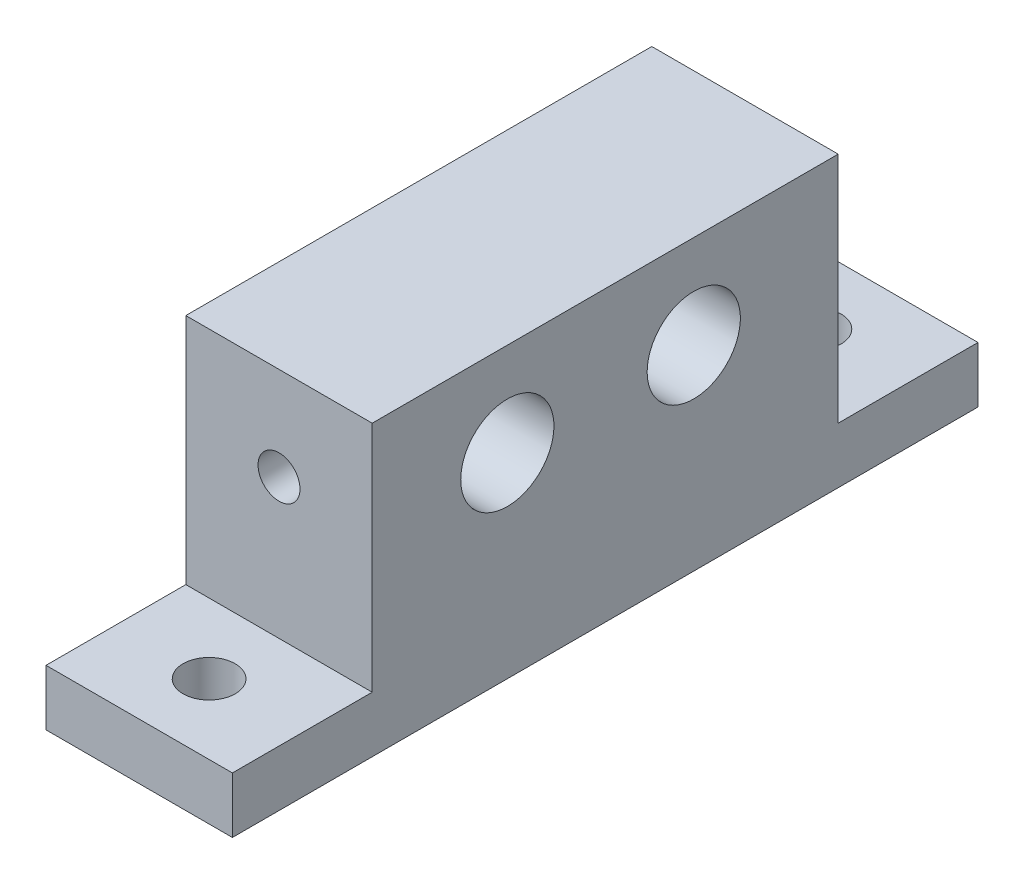
ISO-10303-21;
HEADER;
FILE_DESCRIPTION(('STEP AP214'),'2;1');
FILE_NAME('part.step','',(''),(''),'','','');
FILE_SCHEMA(('AUTOMOTIVE_DESIGN { 1 0 10303 214 1 1 1 1 }'));
ENDSEC;
DATA;
#1=APPLICATION_CONTEXT('core data for automotive mechanical design processes');
#2=APPLICATION_PROTOCOL_DEFINITION('international standard','automotive_design',2000,#1);
#3=PRODUCT_CONTEXT('',#1,'mechanical');
#4=PRODUCT('Part','Part','',(#3));
#5=PRODUCT_RELATED_PRODUCT_CATEGORY('part','',(#4));
#6=PRODUCT_DEFINITION_FORMATION('','',#4);
#7=PRODUCT_DEFINITION_CONTEXT('part definition',#1,'design');
#8=PRODUCT_DEFINITION('design','',#6,#7);
#9=PRODUCT_DEFINITION_SHAPE('','',#8);
#10=(LENGTH_UNIT() NAMED_UNIT(*) SI_UNIT(.MILLI.,.METRE.));
#11=(NAMED_UNIT(*) PLANE_ANGLE_UNIT() SI_UNIT($,.RADIAN.));
#12=(NAMED_UNIT(*) SI_UNIT($,.STERADIAN.) SOLID_ANGLE_UNIT());
#13=UNCERTAINTY_MEASURE_WITH_UNIT(LENGTH_MEASURE(1.E-05),#10,'distance_accuracy_value','');
#14=(GEOMETRIC_REPRESENTATION_CONTEXT(3) GLOBAL_UNCERTAINTY_ASSIGNED_CONTEXT((#13)) GLOBAL_UNIT_ASSIGNED_CONTEXT((#10,
#11,#12)) REPRESENTATION_CONTEXT('',''));
#15=CARTESIAN_POINT('',(0.,0.,0.));
#16=DIRECTION('',(0.,0.,1.));
#17=DIRECTION('',(1.,0.,0.));
#18=AXIS2_PLACEMENT_3D('',#15,#16,#17);
#19=CARTESIAN_POINT('',(0.906040268456394,10.,-23.1040268456376));
#20=DIRECTION('',(-1.,0.,0.));
#21=DIRECTION('',(0.,0.,1.));
#22=AXIS2_PLACEMENT_3D('',#19,#20,#21);
#23=PLANE('',#22);
#24=CARTESIAN_POINT('',(0.906040268456395,5.,-15.3540268456376));
#25=DIRECTION('',(-1.,0.,0.));
#26=DIRECTION('',(0.,0.,1.));
#27=AXIS2_PLACEMENT_3D('',#24,#25,#26);
#28=CIRCLE('',#27,2.5);
#29=CARTESIAN_POINT('',(0.906040268456395,5.,-12.8540268456376));
#30=VERTEX_POINT('',#29);
#31=EDGE_CURVE('E183',#30,#30,#28,.T.);
#32=ORIENTED_EDGE('',*,*,#31,.T.);
#33=EDGE_LOOP('',(#32));
#34=FACE_BOUND('',#33,.T.);
#35=CARTESIAN_POINT('',(0.906040268456396,5.,-5.35402684563758));
#36=DIRECTION('',(-1.,0.,0.));
#37=DIRECTION('',(0.,0.,1.));
#38=AXIS2_PLACEMENT_3D('',#35,#36,#37);
#39=CIRCLE('',#38,2.5);
#40=CARTESIAN_POINT('',(0.906040268456397,5.,-2.85402684563758));
#41=VERTEX_POINT('',#40);
#42=EDGE_CURVE('E186',#41,#41,#39,.T.);
#43=ORIENTED_EDGE('',*,*,#42,.T.);
#44=EDGE_LOOP('',(#43));
#45=FACE_BOUND('',#44,.T.);
#46=DIRECTION('',(0.,-1.,0.));
#47=VECTOR('',#46,1.);
#48=CARTESIAN_POINT('',(0.906040268456397,10.,1.89597315436242));
#49=LINE('',#48,#47);
#50=CARTESIAN_POINT('',(0.906040268456397,10.,1.89597315436242));
#51=VERTEX_POINT('',#50);
#52=CARTESIAN_POINT('',(0.906040268456397,-2.5,1.89597315436242));
#53=VERTEX_POINT('',#52);
#54=EDGE_CURVE('E202',#51,#53,#49,.T.);
#55=ORIENTED_EDGE('',*,*,#54,.T.);
#56=DIRECTION('',(0.,0.,1.));
#57=VECTOR('',#56,1.);
#58=CARTESIAN_POINT('',(0.906040268456399,-2.5,-30.6040268456376));
#59=LINE('',#58,#57);
#60=CARTESIAN_POINT('',(0.906040268456399,-2.5,9.39597315436242));
#61=VERTEX_POINT('',#60);
#62=EDGE_CURVE('E117',#53,#61,#59,.T.);
#63=ORIENTED_EDGE('',*,*,#62,.T.);
#64=DIRECTION('',(0.,1.,0.));
#65=VECTOR('',#64,1.);
#66=CARTESIAN_POINT('',(0.906040268456399,-5.5,9.39597315436242));
#67=LINE('',#66,#65);
#68=CARTESIAN_POINT('',(0.906040268456399,-5.5,9.39597315436242));
#69=VERTEX_POINT('',#68);
#70=EDGE_CURVE('E99',#69,#61,#67,.T.);
#71=ORIENTED_EDGE('',*,*,#70,.F.);
#72=DIRECTION('',(0.,0.,1.));
#73=VECTOR('',#72,1.);
#74=CARTESIAN_POINT('',(0.906040268456399,-5.5,-30.6040268456376));
#75=LINE('',#74,#73);
#76=CARTESIAN_POINT('',(0.906040268456399,-5.5,-30.6040268456376));
#77=VERTEX_POINT('',#76);
#78=EDGE_CURVE('E105',#77,#69,#75,.T.);
#79=ORIENTED_EDGE('',*,*,#78,.F.);
#80=DIRECTION('',(0.,1.,0.));
#81=VECTOR('',#80,1.);
#82=CARTESIAN_POINT('',(0.906040268456399,-5.5,-30.6040268456376));
#83=LINE('',#82,#81);
#84=CARTESIAN_POINT('',(0.906040268456399,-2.5,-30.6040268456376));
#85=VERTEX_POINT('',#84);
#86=EDGE_CURVE('E227',#77,#85,#83,.T.);
#87=ORIENTED_EDGE('',*,*,#86,.T.);
#88=CARTESIAN_POINT('',(0.906040268456399,-2.5,-23.1040268456376));
#89=VERTEX_POINT('',#88);
#90=EDGE_CURVE('E222',#85,#89,#59,.T.);
#91=ORIENTED_EDGE('',*,*,#90,.T.);
#92=DIRECTION('',(0.,-1.,0.));
#93=VECTOR('',#92,1.);
#94=CARTESIAN_POINT('',(0.906040268456394,10.,-23.1040268456376));
#95=LINE('',#94,#93);
#96=CARTESIAN_POINT('',(0.906040268456394,10.,-23.1040268456376));
#97=VERTEX_POINT('',#96);
#98=EDGE_CURVE('E11',#97,#89,#95,.T.);
#99=ORIENTED_EDGE('',*,*,#98,.F.);
#100=DIRECTION('',(0.,0.,-1.));
#101=VECTOR('',#100,1.);
#102=CARTESIAN_POINT('',(0.906040268456394,10.,-23.1040268456376));
#103=LINE('',#102,#101);
#104=EDGE_CURVE('E188',#51,#97,#103,.T.);
#105=ORIENTED_EDGE('',*,*,#104,.F.);
#106=EDGE_LOOP('',(#55,#63,#71,#79,#87,#91,#99,#105));
#107=FACE_BOUND('',#106,.T.);
#108=ADVANCED_FACE('F32',(#34,#45,#107),#23,.F.);
#109=CARTESIAN_POINT('',(-9.09395973154361,10.,-23.1040268456376));
#110=DIRECTION('',(0.,0.,1.));
#111=DIRECTION('',(1.,0.,0.));
#112=AXIS2_PLACEMENT_3D('',#109,#110,#111);
#113=PLANE('',#112);
#114=CARTESIAN_POINT('',(-4.09395973154361,5.,-23.1040268456376));
#115=DIRECTION('',(0.,0.,-1.));
#116=DIRECTION('',(-1.,0.,0.));
#117=AXIS2_PLACEMENT_3D('',#114,#115,#116);
#118=CIRCLE('',#117,1.125);
#119=CARTESIAN_POINT('',(-5.21895973154361,5.,-23.1040268456376));
#120=VERTEX_POINT('',#119);
#121=EDGE_CURVE('E130',#120,#120,#118,.T.);
#122=ORIENTED_EDGE('',*,*,#121,.F.);
#123=EDGE_LOOP('',(#122));
#124=FACE_BOUND('',#123,.T.);
#125=ORIENTED_EDGE('',*,*,#98,.T.);
#126=DIRECTION('',(1.,0.,0.));
#127=VECTOR('',#126,1.);
#128=CARTESIAN_POINT('',(0.906040268456399,-2.5,-23.1040268456376));
#129=LINE('',#128,#127);
#130=CARTESIAN_POINT('',(-9.09395973154361,-2.5,-23.1040268456376));
#131=VERTEX_POINT('',#130);
#132=EDGE_CURVE('E122',#131,#89,#129,.T.);
#133=ORIENTED_EDGE('',*,*,#132,.F.);
#134=DIRECTION('',(0.,-1.,0.));
#135=VECTOR('',#134,1.);
#136=CARTESIAN_POINT('',(-9.09395973154361,10.,-23.1040268456376));
#137=LINE('',#136,#135);
#138=CARTESIAN_POINT('',(-9.09395973154361,10.,-23.1040268456376));
#139=VERTEX_POINT('',#138);
#140=EDGE_CURVE('E39',#139,#131,#137,.T.);
#141=ORIENTED_EDGE('',*,*,#140,.F.);
#142=DIRECTION('',(-1.,0.,0.));
#143=VECTOR('',#142,1.);
#144=CARTESIAN_POINT('',(-9.09395973154361,10.,-23.1040268456376));
#145=LINE('',#144,#143);
#146=EDGE_CURVE('E191',#97,#139,#145,.T.);
#147=ORIENTED_EDGE('',*,*,#146,.F.);
#148=EDGE_LOOP('',(#125,#133,#141,#147));
#149=FACE_BOUND('',#148,.T.);
#150=ADVANCED_FACE('F173',(#124,#149),#113,.F.);
#151=CARTESIAN_POINT('',(-9.09395973154361,10.,-23.1040268456376));
#152=DIRECTION('',(1.,0.,0.));
#153=DIRECTION('',(0.,0.,-1.));
#154=AXIS2_PLACEMENT_3D('',#151,#152,#153);
#155=PLANE('',#154);
#156=CARTESIAN_POINT('',(-9.09395973154361,5.,-15.3540268456376));
#157=DIRECTION('',(-1.,0.,0.));
#158=DIRECTION('',(0.,0.,1.));
#159=AXIS2_PLACEMENT_3D('',#156,#157,#158);
#160=CIRCLE('',#159,2.5);
#161=CARTESIAN_POINT('',(-9.09395973154361,5.,-12.8540268456376));
#162=VERTEX_POINT('',#161);
#163=EDGE_CURVE('E196',#162,#162,#160,.T.);
#164=ORIENTED_EDGE('',*,*,#163,.F.);
#165=EDGE_LOOP('',(#164));
#166=FACE_BOUND('',#165,.T.);
#167=CARTESIAN_POINT('',(-9.0939597315436,5.,-5.35402684563758));
#168=DIRECTION('',(-1.,0.,0.));
#169=DIRECTION('',(0.,0.,1.));
#170=AXIS2_PLACEMENT_3D('',#167,#168,#169);
#171=CIRCLE('',#170,2.5);
#172=CARTESIAN_POINT('',(-9.0939597315436,5.,-2.85402684563758));
#173=VERTEX_POINT('',#172);
#174=EDGE_CURVE('E189',#173,#173,#171,.T.);
#175=ORIENTED_EDGE('',*,*,#174,.F.);
#176=EDGE_LOOP('',(#175));
#177=FACE_BOUND('',#176,.T.);
#178=ORIENTED_EDGE('',*,*,#140,.T.);
#179=DIRECTION('',(0.,0.,-1.));
#180=VECTOR('',#179,1.);
#181=CARTESIAN_POINT('',(-9.09395973154361,-2.5,-30.6040268456376));
#182=LINE('',#181,#180);
#183=CARTESIAN_POINT('',(-9.09395973154361,-2.5,-30.6040268456376));
#184=VERTEX_POINT('',#183);
#185=EDGE_CURVE('E210',#131,#184,#182,.T.);
#186=ORIENTED_EDGE('',*,*,#185,.T.);
#187=DIRECTION('',(0.,1.,0.));
#188=VECTOR('',#187,1.);
#189=CARTESIAN_POINT('',(-9.09395973154361,-5.5,-30.6040268456376));
#190=LINE('',#189,#188);
#191=CARTESIAN_POINT('',(-9.09395973154361,-5.5,-30.6040268456376));
#192=VERTEX_POINT('',#191);
#193=EDGE_CURVE('E124',#192,#184,#190,.T.);
#194=ORIENTED_EDGE('',*,*,#193,.F.);
#195=DIRECTION('',(0.,0.,-1.));
#196=VECTOR('',#195,1.);
#197=CARTESIAN_POINT('',(-9.09395973154361,-5.5,-30.6040268456376));
#198=LINE('',#197,#196);
#199=CARTESIAN_POINT('',(-9.09395973154361,-5.5,9.39597315436242));
#200=VERTEX_POINT('',#199);
#201=EDGE_CURVE('E104',#200,#192,#198,.T.);
#202=ORIENTED_EDGE('',*,*,#201,.F.);
#203=DIRECTION('',(0.,1.,0.));
#204=VECTOR('',#203,1.);
#205=CARTESIAN_POINT('',(-9.09395973154361,-5.5,9.39597315436242));
#206=LINE('',#205,#204);
#207=CARTESIAN_POINT('',(-9.09395973154361,-2.5,9.39597315436242));
#208=VERTEX_POINT('',#207);
#209=EDGE_CURVE('E101',#200,#208,#206,.T.);
#210=ORIENTED_EDGE('',*,*,#209,.T.);
#211=CARTESIAN_POINT('',(-9.09395973154361,-2.5,1.89597315436242));
#212=VERTEX_POINT('',#211);
#213=EDGE_CURVE('E218',#208,#212,#182,.T.);
#214=ORIENTED_EDGE('',*,*,#213,.T.);
#215=DIRECTION('',(0.,-1.,0.));
#216=VECTOR('',#215,1.);
#217=CARTESIAN_POINT('',(-9.0939597315436,10.,1.89597315436242));
#218=LINE('',#217,#216);
#219=CARTESIAN_POINT('',(-9.0939597315436,10.,1.89597315436242));
#220=VERTEX_POINT('',#219);
#221=EDGE_CURVE('E204',#220,#212,#218,.T.);
#222=ORIENTED_EDGE('',*,*,#221,.F.);
#223=DIRECTION('',(0.,0.,1.));
#224=VECTOR('',#223,1.);
#225=CARTESIAN_POINT('',(-9.09395973154361,10.,-23.1040268456376));
#226=LINE('',#225,#224);
#227=EDGE_CURVE('E51',#139,#220,#226,.T.);
#228=ORIENTED_EDGE('',*,*,#227,.F.);
#229=EDGE_LOOP('',(#178,#186,#194,#202,#210,#214,#222,#228));
#230=FACE_BOUND('',#229,.T.);
#231=ADVANCED_FACE('F178',(#166,#177,#230),#155,.F.);
#232=CARTESIAN_POINT('',(-9.0939597315436,10.,1.89597315436242));
#233=DIRECTION('',(0.,0.,-1.));
#234=DIRECTION('',(-1.,0.,0.));
#235=AXIS2_PLACEMENT_3D('',#232,#233,#234);
#236=PLANE('',#235);
#237=CARTESIAN_POINT('',(-4.0939597315436,5.,1.89597315436242));
#238=DIRECTION('',(0.,0.,1.));
#239=DIRECTION('',(1.,0.,0.));
#240=AXIS2_PLACEMENT_3D('',#237,#238,#239);
#241=CIRCLE('',#240,1.125);
#242=CARTESIAN_POINT('',(-2.9689597315436,5.,1.89597315436242));
#243=VERTEX_POINT('',#242);
#244=EDGE_CURVE('E140',#243,#243,#241,.T.);
#245=ORIENTED_EDGE('',*,*,#244,.F.);
#246=EDGE_LOOP('',(#245));
#247=FACE_BOUND('',#246,.T.);
#248=ORIENTED_EDGE('',*,*,#221,.T.);
#249=DIRECTION('',(-1.,0.,0.));
#250=VECTOR('',#249,1.);
#251=CARTESIAN_POINT('',(0.906040268456397,-2.5,1.89597315436242));
#252=LINE('',#251,#250);
#253=EDGE_CURVE('E119',#53,#212,#252,.T.);
#254=ORIENTED_EDGE('',*,*,#253,.F.);
#255=ORIENTED_EDGE('',*,*,#54,.F.);
#256=DIRECTION('',(1.,0.,0.));
#257=VECTOR('',#256,1.);
#258=CARTESIAN_POINT('',(-9.0939597315436,10.,1.89597315436242));
#259=LINE('',#258,#257);
#260=EDGE_CURVE('E46',#220,#51,#259,.T.);
#261=ORIENTED_EDGE('',*,*,#260,.F.);
#262=EDGE_LOOP('',(#248,#254,#255,#261));
#263=FACE_BOUND('',#262,.T.);
#264=ADVANCED_FACE('F296',(#247,#263),#236,.F.);
#265=CARTESIAN_POINT('',(0.,10.,0.));
#266=DIRECTION('',(0.,1.,0.));
#267=DIRECTION('',(0.,0.,1.));
#268=AXIS2_PLACEMENT_3D('',#265,#266,#267);
#269=PLANE('',#268);
#270=ORIENTED_EDGE('',*,*,#104,.T.);
#271=ORIENTED_EDGE('',*,*,#146,.T.);
#272=ORIENTED_EDGE('',*,*,#227,.T.);
#273=ORIENTED_EDGE('',*,*,#260,.T.);
#274=EDGE_LOOP('',(#270,#271,#272,#273));
#275=FACE_BOUND('',#274,.T.);
#276=ADVANCED_FACE('F319',(#275),#269,.T.);
#277=CARTESIAN_POINT('',(0.906040268456396,5.,-5.35402684563758));
#278=DIRECTION('',(-1.,0.,0.));
#279=DIRECTION('',(0.,0.,1.));
#280=AXIS2_PLACEMENT_3D('',#277,#278,#279);
#281=CYLINDRICAL_SURFACE('',#280,2.5);
#282=CARTESIAN_POINT('',(-2.9689597315436,5.,-2.85402684563758));
#283=CARTESIAN_POINT('',(-2.96896684793247,4.94015934388376,-2.85403235096913));
#284=CARTESIAN_POINT('',(-2.97376157866034,4.88024815676464,-2.85619926685468));
#285=CARTESIAN_POINT('',(-2.99275835605259,4.7621428377375,-2.86465923216893));
#286=CARTESIAN_POINT('',(-3.0069825829791,4.70395309297606,-2.87096200970438));
#287=CARTESIAN_POINT('',(-3.04418916322397,4.59119993982031,-2.88702190461139));
#288=CARTESIAN_POINT('',(-3.06713996711316,4.53662429020341,-2.89676656951957));
#289=CARTESIAN_POINT('',(-3.1210064988605,4.43215897279167,-2.91878346415048));
#290=CARTESIAN_POINT('',(-3.15192053129086,4.3822683106113,-2.93105515573989));
#291=CARTESIAN_POINT('',(-3.22267462967668,4.28567909823027,-2.9576995883806));
#292=CARTESIAN_POINT('',(-3.26289397501426,4.23927956448851,-2.9721482156891));
#293=CARTESIAN_POINT('',(-3.35031092427556,4.15361930423994,-3.00122217479857));
#294=CARTESIAN_POINT('',(-3.39751276102208,4.11436294037779,-3.01584760880746));
#295=CARTESIAN_POINT('',(-3.50094913066191,4.04177907137339,-3.04460529959212));
#296=CARTESIAN_POINT('',(-3.55755418448914,4.00894387544925,-3.05865631560645));
#297=CARTESIAN_POINT('',(-3.67620046019733,3.95339336866517,-3.08344397196429));
#298=CARTESIAN_POINT('',(-3.73823840711098,3.93067201071919,-3.09418259161434));
#299=CARTESIAN_POINT('',(-3.86255634073284,3.89727889614832,-3.11029437635455));
#300=CARTESIAN_POINT('',(-3.92464614394823,3.88602798690122,-3.11592365199849));
#301=CARTESIAN_POINT('',(-4.05006743179297,3.87409628928429,-3.12189998535975));
#302=CARTESIAN_POINT('',(-4.11339802400473,3.87340816442218,-3.122250709347));
#303=CARTESIAN_POINT('',(-4.23325070245578,3.88219042906747,-3.11784327871633));
#304=CARTESIAN_POINT('',(-4.28986195990982,3.89072962122964,-3.11355339845975));
#305=CARTESIAN_POINT('',(-4.40074071976355,3.91614257027688,-3.10115071554685));
#306=CARTESIAN_POINT('',(-4.45500767462349,3.93301826292779,-3.09303702500795));
#307=CARTESIAN_POINT('',(-4.56112906423611,3.97495930169906,-3.07371264345156));
#308=CARTESIAN_POINT('',(-4.61290111404201,4.00020133520256,-3.06243602326069));
#309=CARTESIAN_POINT('',(-4.71169677892388,4.05803087497515,-3.03806540579113));
#310=CARTESIAN_POINT('',(-4.75871836105678,4.09062150692669,-3.02497063608674));
#311=CARTESIAN_POINT('',(-4.85163506868085,4.16604434262729,-2.99684787412248));
#312=CARTESIAN_POINT('',(-4.8969459222416,4.20957529505649,-2.98175759932769));
#313=CARTESIAN_POINT('',(-4.97983890011886,4.30373919724185,-2.95243327435146));
#314=CARTESIAN_POINT('',(-5.01741857091956,4.35437439300416,-2.93819949699305));
#315=CARTESIAN_POINT('',(-5.08484161922018,4.46333833032342,-2.91164470694774));
#316=CARTESIAN_POINT('',(-5.11440926433335,4.52185681780184,-2.89939661121026));
#317=CARTESIAN_POINT('',(-5.16306871727106,4.64373009114417,-2.87877322668916));
#318=CARTESIAN_POINT('',(-5.18216729674547,4.70708172052749,-2.87039543505017));
#319=CARTESIAN_POINT('',(-5.20803573485279,4.83197453610223,-2.8589483801348));
#320=CARTESIAN_POINT('',(-5.21558728670496,4.89332293729947,-2.85554331737642));
#321=CARTESIAN_POINT('',(-5.22052441842713,5.01650142747981,-2.85332360420892));
#322=CARTESIAN_POINT('',(-5.21791356858974,5.07833133967908,-2.85450734164491));
#323=CARTESIAN_POINT('',(-5.20312346740592,5.19680319855134,-2.86112072970214));
#324=CARTESIAN_POINT('',(-5.19152667073549,5.25353407156352,-2.86629182965115));
#325=CARTESIAN_POINT('',(-5.15994316670344,5.36416308562148,-2.88006354121446));
#326=CARTESIAN_POINT('',(-5.13995544882012,5.41806088459915,-2.8886645658896));
#327=CARTESIAN_POINT('',(-5.09152745846349,5.52340164222414,-2.90882386761901));
#328=CARTESIAN_POINT('',(-5.06284351942287,5.57471602458654,-2.92046583803545));
#329=CARTESIAN_POINT('',(-4.99810281043689,5.67198777311959,-2.94550879106172));
#330=CARTESIAN_POINT('',(-4.96204281549041,5.7179427821876,-2.95891054217202));
#331=CARTESIAN_POINT('',(-4.88011456487305,5.80718665667939,-2.98742140530551));
#332=CARTESIAN_POINT('',(-4.83368289802132,5.8499436780132,-3.00258020281054));
#333=CARTESIAN_POINT('',(-4.73412944959314,5.92724388336511,-3.0319732606774));
#334=CARTESIAN_POINT('',(-4.68100511389809,5.96178391692702,-3.04620716491261));
#335=CARTESIAN_POINT('',(-4.56775373460087,6.02243438617339,-3.07241533886361));
#336=CARTESIAN_POINT('',(-4.50748227402379,6.04830647557111,-3.08432245926676));
#337=CARTESIAN_POINT('',(-4.38272654168235,6.08928321476952,-3.1036969072837));
#338=CARTESIAN_POINT('',(-4.31824659939731,6.10439874556806,-3.11116872024271));
#339=CARTESIAN_POINT('',(-4.19288602547662,6.12227264493927,-3.12006295255407));
#340=CARTESIAN_POINT('',(-4.13217417631789,6.12598379336671,-3.12195126561994));
#341=CARTESIAN_POINT('',(-4.01100440725229,6.12357133038904,-3.12073550402814));
#342=CARTESIAN_POINT('',(-3.95054643255767,6.11744996319945,-3.11763256859422));
#343=CARTESIAN_POINT('',(-3.83557582033434,6.09638672665954,-3.10723826382512));
#344=CARTESIAN_POINT('',(-3.78092889956794,6.08202664110842,-3.10022393906388));
#345=CARTESIAN_POINT('',(-3.67483124749401,6.04551718620685,-3.08305823730165));
#346=CARTESIAN_POINT('',(-3.62338145138403,6.02336555023657,-3.07290594754768));
#347=CARTESIAN_POINT('',(-3.52148843869423,5.9702644728048,-3.04979691191085));
#348=CARTESIAN_POINT('',(-3.47132583348344,5.93883845525323,-3.03670119429621));
#349=CARTESIAN_POINT('',(-3.37669076542571,5.86869033206255,-3.00950311265023));
#350=CARTESIAN_POINT('',(-3.33222076757414,5.82996508355747,-2.99540031662694));
#351=CARTESIAN_POINT('',(-3.24606839067087,5.74217308014032,-2.96624451215374));
#352=CARTESIAN_POINT('',(-3.20500358874225,5.69248725764113,-2.95122117426471));
#353=CARTESIAN_POINT('',(-3.13172254137509,5.58641197297774,-2.92315723240211));
#354=CARTESIAN_POINT('',(-3.09951036569654,5.53001944459476,-2.91011754158339));
#355=CARTESIAN_POINT('',(-3.04534960403366,5.41253469652198,-2.88758055721452));
#356=CARTESIAN_POINT('',(-3.02330185010967,5.35149496356945,-2.87804922783643));
#357=CARTESIAN_POINT('',(-2.99002976700826,5.22614491321327,-2.86348331242741));
#358=CARTESIAN_POINT('',(-2.97877261288656,5.16184514525295,-2.8584350922716));
#359=CARTESIAN_POINT('',(-2.9703559184388,5.06478811161944,-2.85465468356607));
#360=CARTESIAN_POINT('',(-2.96895587793798,5.03240439687442,-2.85402386443783));
#361=CARTESIAN_POINT('',(-2.9689597315436,5.,-2.85402684563758));
#362=B_SPLINE_CURVE_WITH_KNOTS('',3,(#282,#283,#284,#285,#286,#287,#288,#289,#290,#291,#292,
#293,#294,#295,#296,#297,#298,#299,#300,#301,#302,#303,#304,#305,#306,#307,#308,#309,#310,#311,
#312,#313,#314,#315,#316,#317,#318,#319,#320,#321,#322,#323,#324,#325,#326,#327,#328,#329,#330,
#331,#332,#333,#334,#335,#336,#337,#338,#339,#340,#341,#342,#343,#344,#345,#346,#347,#348,#349,
#350,#351,#352,#353,#354,#355,#356,#357,#358,#359,#360,#361),.UNSPECIFIED.,.T.,.F.,(4,2,2,2,2,2,
2,2,2,2,2,2,2,2,2,2,2,2,2,2,2,2,2,2,2,2,2,2,2,2,2,2,2,2,2,2,2,2,2,4),(0.,0.179419237022681,
0.359262012443141,0.538460686173583,0.717621238725448,0.906057945200411,1.09460935469443,
1.29438961699544,1.49405026926087,1.68303876629531,1.87189599344994,2.04333245208276,
2.21480873761229,2.39016548189478,2.56559695429306,2.75859505640729,2.95165431293092,
3.15069444049712,3.34960567162393,3.53433977757448,3.71900898791338,3.8926176400558,
4.06624720595196,4.24527964851417,4.42439053662341,4.61826244225106,4.81220856048826,
5.01111803379928,5.20982600938805,5.39140724207349,5.57294703576846,5.7430158257555,
5.91313413098937,6.09426158069926,6.27546719824722,6.4730899295991,6.6708033613561,
6.86654472978121,7.06168874645458,7.15884630689467),.UNSPECIFIED.);
#363=CARTESIAN_POINT('',(-2.9689597315436,5.,-2.85402684563758));
#364=VERTEX_POINT('',#363);
#365=EDGE_CURVE('E377',#364,#364,#362,.T.);
#366=ORIENTED_EDGE('',*,*,#365,.F.);
#367=EDGE_LOOP('',(#366));
#368=FACE_BOUND('',#367,.T.);
#369=ORIENTED_EDGE('',*,*,#42,.F.);
#370=EDGE_LOOP('',(#369));
#371=FACE_BOUND('',#370,.T.);
#372=ORIENTED_EDGE('',*,*,#174,.T.);
#373=EDGE_LOOP('',(#372));
#374=FACE_BOUND('',#373,.T.);
#375=ADVANCED_FACE('F332',(#368,#371,#374),#281,.F.);
#376=CARTESIAN_POINT('',(0.906040268456395,5.,-15.3540268456376));
#377=DIRECTION('',(-1.,0.,0.));
#378=DIRECTION('',(0.,0.,1.));
#379=AXIS2_PLACEMENT_3D('',#376,#377,#378);
#380=CYLINDRICAL_SURFACE('',#379,2.5);
#381=CARTESIAN_POINT('',(-5.21895973154361,5.,-17.8540268456376));
#382=CARTESIAN_POINT('',(-5.21895261515474,4.94015934388376,-17.854021340306));
#383=CARTESIAN_POINT('',(-5.21415788442687,4.88024815676464,-17.8518544244205));
#384=CARTESIAN_POINT('',(-5.19516110703462,4.7621428377375,-17.8433944591062));
#385=CARTESIAN_POINT('',(-5.18093688010811,4.70395309297606,-17.8370916815708));
#386=CARTESIAN_POINT('',(-5.14373029986324,4.59119993982031,-17.8210317866638));
#387=CARTESIAN_POINT('',(-5.12077949597405,4.53662429020342,-17.8112871217556));
#388=CARTESIAN_POINT('',(-5.06691296422672,4.43215897279167,-17.7892702271247));
#389=CARTESIAN_POINT('',(-5.03599893179635,4.3822683106113,-17.7769985355353));
#390=CARTESIAN_POINT('',(-4.96524483341053,4.28567909823027,-17.7503541028946));
#391=CARTESIAN_POINT('',(-4.92502548807295,4.23927956448851,-17.7359054755861));
#392=CARTESIAN_POINT('',(-4.83760853881165,4.15361930423994,-17.7068315164766));
#393=CARTESIAN_POINT('',(-4.79040670206513,4.1143629403778,-17.6922060824677));
#394=CARTESIAN_POINT('',(-4.6869703324253,4.04177907137339,-17.663448391683));
#395=CARTESIAN_POINT('',(-4.63036527859807,4.00894387544925,-17.6493973756687));
#396=CARTESIAN_POINT('',(-4.51171900288988,3.95339336866517,-17.6246097193109));
#397=CARTESIAN_POINT('',(-4.44968105597623,3.93067201071919,-17.6138710996608));
#398=CARTESIAN_POINT('',(-4.32536312235437,3.89727889614832,-17.5977593149206));
#399=CARTESIAN_POINT('',(-4.26327331913898,3.88602798690122,-17.5921300392767));
#400=CARTESIAN_POINT('',(-4.13785203129424,3.87409628928429,-17.5861537059154));
#401=CARTESIAN_POINT('',(-4.07452143908248,3.87340816442218,-17.5858029819282));
#402=CARTESIAN_POINT('',(-3.95466876063143,3.88219042906747,-17.5902104125588));
#403=CARTESIAN_POINT('',(-3.89805750317739,3.89072962122964,-17.5945002928154));
#404=CARTESIAN_POINT('',(-3.78717874332366,3.91614257027688,-17.6069029757283));
#405=CARTESIAN_POINT('',(-3.73291178846372,3.93301826292779,-17.6150166662672));
#406=CARTESIAN_POINT('',(-3.6267903988511,3.97495930169906,-17.6343410478236));
#407=CARTESIAN_POINT('',(-3.5750183490452,4.00020133520256,-17.6456176680145));
#408=CARTESIAN_POINT('',(-3.47622268416333,4.05803087497515,-17.669988285484));
#409=CARTESIAN_POINT('',(-3.42920110203043,4.09062150692669,-17.6830830551884));
#410=CARTESIAN_POINT('',(-3.33628439440636,4.16604434262729,-17.7112058171527));
#411=CARTESIAN_POINT('',(-3.29097354084561,4.20957529505649,-17.7262960919475));
#412=CARTESIAN_POINT('',(-3.20808056296835,4.30373919724185,-17.7556204169237));
#413=CARTESIAN_POINT('',(-3.17050089216765,4.35437439300416,-17.7698541942821));
#414=CARTESIAN_POINT('',(-3.10307784386703,4.46333833032341,-17.7964089843274));
#415=CARTESIAN_POINT('',(-3.07351019875386,4.52185681780183,-17.8086570800649));
#416=CARTESIAN_POINT('',(-3.02485074581615,4.64373009114417,-17.829280464586));
#417=CARTESIAN_POINT('',(-3.00575216634174,4.70708172052749,-17.837658256225));
#418=CARTESIAN_POINT('',(-2.97988372823442,4.83197453610223,-17.8491053111404));
#419=CARTESIAN_POINT('',(-2.97233217638225,4.89332293729947,-17.8525103738987));
#420=CARTESIAN_POINT('',(-2.96739504466008,5.01650142747981,-17.8547300870662));
#421=CARTESIAN_POINT('',(-2.97000589449747,5.07833133967908,-17.8535463496302));
#422=CARTESIAN_POINT('',(-2.98479599568129,5.19680319855134,-17.846932961573));
#423=CARTESIAN_POINT('',(-2.99639279235172,5.25353407156352,-17.841761861624));
#424=CARTESIAN_POINT('',(-3.02797629638377,5.36416308562148,-17.8279901500607));
#425=CARTESIAN_POINT('',(-3.04796401426709,5.41806088459915,-17.8193891253856));
#426=CARTESIAN_POINT('',(-3.09639200462372,5.52340164222414,-17.7992298236562));
#427=CARTESIAN_POINT('',(-3.12507594366434,5.57471602458654,-17.7875878532397));
#428=CARTESIAN_POINT('',(-3.18981665265032,5.67198777311959,-17.7625449002134));
#429=CARTESIAN_POINT('',(-3.2258766475968,5.7179427821876,-17.7491431491031));
#430=CARTESIAN_POINT('',(-3.30780489821416,5.80718665667939,-17.7206322859696));
#431=CARTESIAN_POINT('',(-3.35423656506589,5.8499436780132,-17.7054734884646));
#432=CARTESIAN_POINT('',(-3.45379001349407,5.92724388336511,-17.6760804305978));
#433=CARTESIAN_POINT('',(-3.50691434918912,5.96178391692702,-17.6618465263625));
#434=CARTESIAN_POINT('',(-3.62016572848634,6.02243438617339,-17.6356383524116));
#435=CARTESIAN_POINT('',(-3.68043718906342,6.04830647557111,-17.6237312320084));
#436=CARTESIAN_POINT('',(-3.80519292140486,6.08928321476952,-17.6043567839915));
#437=CARTESIAN_POINT('',(-3.8696728636899,6.10439874556806,-17.5968849710324));
#438=CARTESIAN_POINT('',(-3.99503343761059,6.12227264493927,-17.5879907387211));
#439=CARTESIAN_POINT('',(-4.05574528676932,6.12598379336671,-17.5861024256552));
#440=CARTESIAN_POINT('',(-4.17691505583492,6.12357133038904,-17.587318187247));
#441=CARTESIAN_POINT('',(-4.23737303052954,6.11744996319945,-17.5904211226809));
#442=CARTESIAN_POINT('',(-4.35234364275287,6.09638672665954,-17.60081542745));
#443=CARTESIAN_POINT('',(-4.40699056351928,6.08202664110842,-17.6078297522113));
#444=CARTESIAN_POINT('',(-4.5130882155932,6.04551718620685,-17.6249954539735));
#445=CARTESIAN_POINT('',(-4.56453801170318,6.02336555023657,-17.6351477437275));
#446=CARTESIAN_POINT('',(-4.66643102439298,5.9702644728048,-17.6582567793643));
#447=CARTESIAN_POINT('',(-4.71659362960377,5.93883845525323,-17.6713524969789));
#448=CARTESIAN_POINT('',(-4.8112286976615,5.86869033206255,-17.6985505786249));
#449=CARTESIAN_POINT('',(-4.85569869551307,5.82996508355747,-17.7126533746482));
#450=CARTESIAN_POINT('',(-4.94185107241634,5.74217308014032,-17.7418091791214));
#451=CARTESIAN_POINT('',(-4.98291587434496,5.69248725764113,-17.7568325170104));
#452=CARTESIAN_POINT('',(-5.05619692171212,5.58641197297774,-17.784896458873));
#453=CARTESIAN_POINT('',(-5.08840909739067,5.53001944459476,-17.7979361496918));
#454=CARTESIAN_POINT('',(-5.14256985905355,5.41253469652198,-17.8204731340606));
#455=CARTESIAN_POINT('',(-5.16461761297754,5.35149496356945,-17.8300044634387));
#456=CARTESIAN_POINT('',(-5.19788969607895,5.22614491321327,-17.8445703788477));
#457=CARTESIAN_POINT('',(-5.20914685020066,5.16184514525295,-17.8496185990036));
#458=CARTESIAN_POINT('',(-5.21756354464842,5.06478811161944,-17.8533990077091));
#459=CARTESIAN_POINT('',(-5.21896358514923,5.03240439687442,-17.8540298268373));
#460=CARTESIAN_POINT('',(-5.21895973154361,5.,-17.8540268456376));
#461=B_SPLINE_CURVE_WITH_KNOTS('',3,(#381,#382,#383,#384,#385,#386,#387,#388,#389,#390,#391,
#392,#393,#394,#395,#396,#397,#398,#399,#400,#401,#402,#403,#404,#405,#406,#407,#408,#409,#410,
#411,#412,#413,#414,#415,#416,#417,#418,#419,#420,#421,#422,#423,#424,#425,#426,#427,#428,#429,
#430,#431,#432,#433,#434,#435,#436,#437,#438,#439,#440,#441,#442,#443,#444,#445,#446,#447,#448,
#449,#450,#451,#452,#453,#454,#455,#456,#457,#458,#459,#460),.UNSPECIFIED.,.T.,.F.,(4,2,2,2,2,2,
2,2,2,2,2,2,2,2,2,2,2,2,2,2,2,2,2,2,2,2,2,2,2,2,2,2,2,2,2,2,2,2,2,4),(0.,0.179419237022681,
0.359262012443141,0.538460686173582,0.717621238725446,0.90605794520041,1.09460935469443,
1.29438961699544,1.49405026926087,1.68303876629531,1.87189599344994,2.04333245208276,
2.21480873761229,2.39016548189478,2.56559695429306,2.75859505640729,2.95165431293092,
3.15069444049712,3.34960567162393,3.53433977757448,3.71900898791338,3.8926176400558,
4.06624720595196,4.24527964851417,4.42439053662341,4.61826244225105,4.81220856048826,
5.01111803379928,5.20982600938805,5.39140724207349,5.57294703576846,5.74301582575551,
5.91313413098937,6.09426158069926,6.27546719824722,6.4730899295991,6.6708033613561,
6.86654472978121,7.06168874645458,7.15884630689467),.UNSPECIFIED.);
#462=CARTESIAN_POINT('',(-5.21895973154361,5.,-17.8540268456376));
#463=VERTEX_POINT('',#462);
#464=EDGE_CURVE('E133',#463,#463,#461,.T.);
#465=ORIENTED_EDGE('',*,*,#464,.F.);
#466=EDGE_LOOP('',(#465));
#467=FACE_BOUND('',#466,.T.);
#468=ORIENTED_EDGE('',*,*,#31,.F.);
#469=EDGE_LOOP('',(#468));
#470=FACE_BOUND('',#469,.T.);
#471=ORIENTED_EDGE('',*,*,#163,.T.);
#472=EDGE_LOOP('',(#471));
#473=FACE_BOUND('',#472,.T.);
#474=ADVANCED_FACE('F338',(#467,#470,#473),#380,.F.);
#475=CARTESIAN_POINT('',(-4.0939597315436,5.,-23.1050268456376));
#476=DIRECTION('',(0.,0.,1.));
#477=DIRECTION('',(1.,0.,0.));
#478=AXIS2_PLACEMENT_3D('',#475,#476,#477);
#479=CYLINDRICAL_SURFACE('',#478,1.125);
#480=ORIENTED_EDGE('',*,*,#365,.T.);
#481=EDGE_LOOP('',(#480));
#482=FACE_BOUND('',#481,.T.);
#483=ORIENTED_EDGE('',*,*,#244,.T.);
#484=EDGE_LOOP('',(#483));
#485=FACE_BOUND('',#484,.T.);
#486=ADVANCED_FACE('F347',(#482,#485),#479,.F.);
#487=CARTESIAN_POINT('',(-4.09395973154361,5.,1.89697315436242));
#488=DIRECTION('',(0.,0.,-1.));
#489=DIRECTION('',(-1.,0.,0.));
#490=AXIS2_PLACEMENT_3D('',#487,#488,#489);
#491=CYLINDRICAL_SURFACE('',#490,1.125);
#492=ORIENTED_EDGE('',*,*,#464,.T.);
#493=EDGE_LOOP('',(#492));
#494=FACE_BOUND('',#493,.T.);
#495=ORIENTED_EDGE('',*,*,#121,.T.);
#496=EDGE_LOOP('',(#495));
#497=FACE_BOUND('',#496,.T.);
#498=ADVANCED_FACE('F142',(#494,#497),#491,.F.);
#499=CARTESIAN_POINT('',(0.,-2.5,0.));
#500=DIRECTION('',(0.,-1.,0.));
#501=DIRECTION('',(0.,0.,-1.));
#502=AXIS2_PLACEMENT_3D('',#499,#500,#501);
#503=PLANE('',#502);
#504=CARTESIAN_POINT('',(-4.0939597315436,-2.5,5.64597315436242));
#505=DIRECTION('',(0.,1.,0.));
#506=DIRECTION('',(0.,0.,1.));
#507=AXIS2_PLACEMENT_3D('',#504,#505,#506);
#508=CIRCLE('',#507,1.4);
#509=CARTESIAN_POINT('',(-4.0939597315436,-2.5,7.04597315436242));
#510=VERTEX_POINT('',#509);
#511=EDGE_CURVE('E233',#510,#510,#508,.T.);
#512=ORIENTED_EDGE('',*,*,#511,.F.);
#513=EDGE_LOOP('',(#512));
#514=FACE_BOUND('',#513,.T.);
#515=ORIENTED_EDGE('',*,*,#62,.F.);
#516=ORIENTED_EDGE('',*,*,#253,.T.);
#517=ORIENTED_EDGE('',*,*,#213,.F.);
#518=DIRECTION('',(-1.,0.,0.));
#519=VECTOR('',#518,1.);
#520=CARTESIAN_POINT('',(0.906040268456399,-2.5,9.39597315436242));
#521=LINE('',#520,#519);
#522=EDGE_CURVE('E219',#61,#208,#521,.T.);
#523=ORIENTED_EDGE('',*,*,#522,.F.);
#524=EDGE_LOOP('',(#515,#516,#517,#523));
#525=FACE_BOUND('',#524,.T.);
#526=ADVANCED_FACE('F154',(#514,#525),#503,.F.);
#527=CARTESIAN_POINT('',(-4.0939597315436,-2.5,-26.8540268456376));
#528=DIRECTION('',(0.,1.,0.));
#529=DIRECTION('',(0.,0.,1.));
#530=AXIS2_PLACEMENT_3D('',#527,#528,#529);
#531=CIRCLE('',#530,1.4);
#532=CARTESIAN_POINT('',(-4.0939597315436,-2.5,-25.4540268456376));
#533=VERTEX_POINT('',#532);
#534=EDGE_CURVE('E243',#533,#533,#531,.T.);
#535=ORIENTED_EDGE('',*,*,#534,.F.);
#536=EDGE_LOOP('',(#535));
#537=FACE_BOUND('',#536,.T.);
#538=ORIENTED_EDGE('',*,*,#185,.F.);
#539=ORIENTED_EDGE('',*,*,#132,.T.);
#540=ORIENTED_EDGE('',*,*,#90,.F.);
#541=DIRECTION('',(1.,0.,0.));
#542=VECTOR('',#541,1.);
#543=CARTESIAN_POINT('',(0.906040268456399,-2.5,-30.6040268456376));
#544=LINE('',#543,#542);
#545=EDGE_CURVE('E114',#184,#85,#544,.T.);
#546=ORIENTED_EDGE('',*,*,#545,.F.);
#547=EDGE_LOOP('',(#538,#539,#540,#546));
#548=FACE_BOUND('',#547,.T.);
#549=ADVANCED_FACE('F150',(#537,#548),#503,.F.);
#550=CARTESIAN_POINT('',(0.906040268456399,-5.5,9.39597315436242));
#551=DIRECTION('',(0.,0.,-1.));
#552=DIRECTION('',(-1.,0.,0.));
#553=AXIS2_PLACEMENT_3D('',#550,#551,#552);
#554=PLANE('',#553);
#555=ORIENTED_EDGE('',*,*,#522,.T.);
#556=ORIENTED_EDGE('',*,*,#209,.F.);
#557=DIRECTION('',(-1.,0.,0.));
#558=VECTOR('',#557,1.);
#559=CARTESIAN_POINT('',(0.906040268456399,-5.5,9.39597315436242));
#560=LINE('',#559,#558);
#561=EDGE_CURVE('E95',#69,#200,#560,.T.);
#562=ORIENTED_EDGE('',*,*,#561,.F.);
#563=ORIENTED_EDGE('',*,*,#70,.T.);
#564=EDGE_LOOP('',(#555,#556,#562,#563));
#565=FACE_BOUND('',#564,.T.);
#566=ADVANCED_FACE('F97',(#565),#554,.F.);
#567=CARTESIAN_POINT('',(0.906040268456399,-5.5,-30.6040268456376));
#568=DIRECTION('',(0.,0.,1.));
#569=DIRECTION('',(1.,0.,0.));
#570=AXIS2_PLACEMENT_3D('',#567,#568,#569);
#571=PLANE('',#570);
#572=ORIENTED_EDGE('',*,*,#545,.T.);
#573=ORIENTED_EDGE('',*,*,#86,.F.);
#574=DIRECTION('',(1.,0.,0.));
#575=VECTOR('',#574,1.);
#576=CARTESIAN_POINT('',(0.906040268456399,-5.5,-30.6040268456376));
#577=LINE('',#576,#575);
#578=EDGE_CURVE('E110',#192,#77,#577,.T.);
#579=ORIENTED_EDGE('',*,*,#578,.F.);
#580=ORIENTED_EDGE('',*,*,#193,.T.);
#581=EDGE_LOOP('',(#572,#573,#579,#580));
#582=FACE_BOUND('',#581,.T.);
#583=ADVANCED_FACE('F149',(#582),#571,.F.);
#584=CARTESIAN_POINT('',(0.,-5.5,0.));
#585=DIRECTION('',(0.,-1.,0.));
#586=DIRECTION('',(0.,0.,-1.));
#587=AXIS2_PLACEMENT_3D('',#584,#585,#586);
#588=PLANE('',#587);
#589=CARTESIAN_POINT('',(-4.0939597315436,-5.5,-26.8540268456376));
#590=DIRECTION('',(0.,-1.,0.));
#591=DIRECTION('',(0.,0.,-1.));
#592=AXIS2_PLACEMENT_3D('',#589,#590,#591);
#593=CIRCLE('',#592,1.4);
#594=CARTESIAN_POINT('',(-4.0939597315436,-5.5,-28.2540268456376));
#595=VERTEX_POINT('',#594);
#596=EDGE_CURVE('E238',#595,#595,#593,.F.);
#597=ORIENTED_EDGE('',*,*,#596,.T.);
#598=EDGE_LOOP('',(#597));
#599=FACE_BOUND('',#598,.T.);
#600=CARTESIAN_POINT('',(-4.0939597315436,-5.5,5.64597315436242));
#601=DIRECTION('',(0.,-1.,0.));
#602=DIRECTION('',(0.,0.,-1.));
#603=AXIS2_PLACEMENT_3D('',#600,#601,#602);
#604=CIRCLE('',#603,1.4);
#605=CARTESIAN_POINT('',(-4.0939597315436,-5.5,4.24597315436242));
#606=VERTEX_POINT('',#605);
#607=EDGE_CURVE('E231',#606,#606,#604,.F.);
#608=ORIENTED_EDGE('',*,*,#607,.T.);
#609=EDGE_LOOP('',(#608));
#610=FACE_BOUND('',#609,.T.);
#611=ORIENTED_EDGE('',*,*,#78,.T.);
#612=ORIENTED_EDGE('',*,*,#561,.T.);
#613=ORIENTED_EDGE('',*,*,#201,.T.);
#614=ORIENTED_EDGE('',*,*,#578,.T.);
#615=EDGE_LOOP('',(#611,#612,#613,#614));
#616=FACE_BOUND('',#615,.T.);
#617=ADVANCED_FACE('F108',(#599,#610,#616),#588,.T.);
#618=CARTESIAN_POINT('',(-4.0939597315436,-9.45979797464467,5.64597315436242));
#619=DIRECTION('',(0.,1.,0.));
#620=DIRECTION('',(0.,0.,1.));
#621=AXIS2_PLACEMENT_3D('',#618,#619,#620);
#622=CYLINDRICAL_SURFACE('',#621,1.4);
#623=ORIENTED_EDGE('',*,*,#511,.T.);
#624=EDGE_LOOP('',(#623));
#625=FACE_BOUND('',#624,.T.);
#626=ORIENTED_EDGE('',*,*,#607,.F.);
#627=EDGE_LOOP('',(#626));
#628=FACE_BOUND('',#627,.T.);
#629=ADVANCED_FACE('F160',(#625,#628),#622,.F.);
#630=CARTESIAN_POINT('',(-4.0939597315436,-9.45979797464467,-26.8540268456376));
#631=DIRECTION('',(0.,1.,0.));
#632=DIRECTION('',(0.,0.,1.));
#633=AXIS2_PLACEMENT_3D('',#630,#631,#632);
#634=CYLINDRICAL_SURFACE('',#633,1.4);
#635=ORIENTED_EDGE('',*,*,#534,.T.);
#636=EDGE_LOOP('',(#635));
#637=FACE_BOUND('',#636,.T.);
#638=ORIENTED_EDGE('',*,*,#596,.F.);
#639=EDGE_LOOP('',(#638));
#640=FACE_BOUND('',#639,.T.);
#641=ADVANCED_FACE('F164',(#637,#640),#634,.F.);
#642=CLOSED_SHELL('',(#108,#150,#231,#264,#276,#375,#474,#486,#498,#526,#549,#566,#583,#617,
#629,#641));
#643=MANIFOLD_SOLID_BREP('B2',#642);
#644=ADVANCED_BREP_SHAPE_REPRESENTATION('',(#18,#643),#14);
#645=SHAPE_DEFINITION_REPRESENTATION(#9,#644);
ENDSEC;
END-ISO-10303-21;
